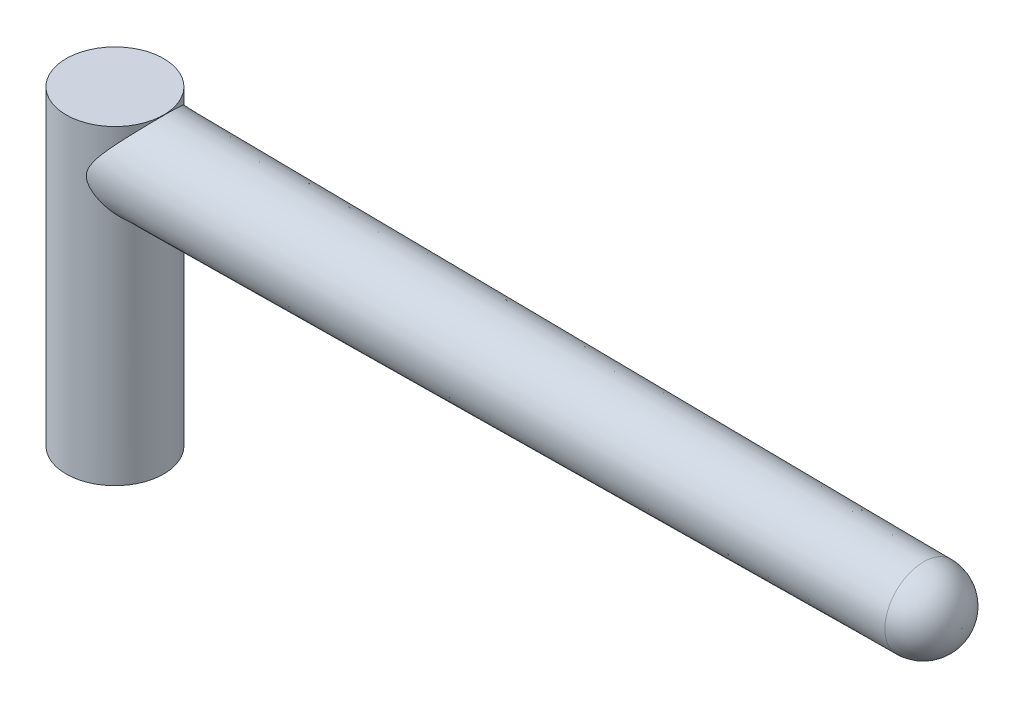
ISO-10303-21;
HEADER;
FILE_DESCRIPTION(('STEP AP214'),'2;1');
FILE_NAME('part.step','',(''),(''),'','','');
FILE_SCHEMA(('AUTOMOTIVE_DESIGN { 1 0 10303 214 1 1 1 1 }'));
ENDSEC;
DATA;
#1=APPLICATION_CONTEXT('core data for automotive mechanical design processes');
#2=APPLICATION_PROTOCOL_DEFINITION('international standard','automotive_design',2000,#1);
#3=PRODUCT_CONTEXT('',#1,'mechanical');
#4=PRODUCT('Part','Part','',(#3));
#5=PRODUCT_RELATED_PRODUCT_CATEGORY('part','',(#4));
#6=PRODUCT_DEFINITION_FORMATION('','',#4);
#7=PRODUCT_DEFINITION_CONTEXT('part definition',#1,'design');
#8=PRODUCT_DEFINITION('design','',#6,#7);
#9=PRODUCT_DEFINITION_SHAPE('','',#8);
#10=(LENGTH_UNIT() NAMED_UNIT(*) SI_UNIT(.MILLI.,.METRE.));
#11=(NAMED_UNIT(*) PLANE_ANGLE_UNIT() SI_UNIT($,.RADIAN.));
#12=(NAMED_UNIT(*) SI_UNIT($,.STERADIAN.) SOLID_ANGLE_UNIT());
#13=UNCERTAINTY_MEASURE_WITH_UNIT(LENGTH_MEASURE(1.E-05),#10,'distance_accuracy_value','');
#14=(GEOMETRIC_REPRESENTATION_CONTEXT(3) GLOBAL_UNCERTAINTY_ASSIGNED_CONTEXT((#13)) GLOBAL_UNIT_ASSIGNED_CONTEXT((#10,
#11,#12)) REPRESENTATION_CONTEXT('',''));
#15=CARTESIAN_POINT('',(0.,0.,0.));
#16=DIRECTION('',(0.,0.,1.));
#17=DIRECTION('',(1.,0.,0.));
#18=AXIS2_PLACEMENT_3D('',#15,#16,#17);
#19=CARTESIAN_POINT('',(0.,31.55,0.));
#20=DIRECTION('',(0.,-1.,0.));
#21=DIRECTION('',(0.,0.,-1.));
#22=AXIS2_PLACEMENT_3D('',#19,#20,#21);
#23=CYLINDRICAL_SURFACE('',#22,4.95);
#24=CARTESIAN_POINT('',(0.,31.55,0.));
#25=DIRECTION('',(0.,1.,0.));
#26=DIRECTION('',(0.,0.,1.));
#27=AXIS2_PLACEMENT_3D('',#24,#25,#26);
#28=CIRCLE('',#27,4.95);
#29=CARTESIAN_POINT('',(0.,31.55,4.95));
#30=VERTEX_POINT('',#29);
#31=EDGE_CURVE('E50',#30,#30,#28,.T.);
#32=ORIENTED_EDGE('',*,*,#31,.F.);
#33=EDGE_LOOP('',(#32));
#34=FACE_BOUND('',#33,.T.);
#35=CARTESIAN_POINT('',(0.,0.,0.));
#36=DIRECTION('',(0.,1.,0.));
#37=DIRECTION('',(0.,0.,1.));
#38=AXIS2_PLACEMENT_3D('',#35,#36,#37);
#39=CIRCLE('',#38,4.95);
#40=CARTESIAN_POINT('',(0.,0.,4.95));
#41=VERTEX_POINT('',#40);
#42=EDGE_CURVE('E53',#41,#41,#39,.T.);
#43=ORIENTED_EDGE('',*,*,#42,.T.);
#44=EDGE_LOOP('',(#43));
#45=FACE_BOUND('',#44,.T.);
#46=CARTESIAN_POINT('',(2.28781793438736,25.4273050165414,-4.38957732579067));
#47=CARTESIAN_POINT('',(2.21650894022856,25.5361198173086,-4.42674227521742));
#48=CARTESIAN_POINT('',(2.14772724216028,25.6478296242196,-4.46035954588733));
#49=CARTESIAN_POINT('',(2.01928691409521,25.8786399118595,-4.51995186240702));
#50=CARTESIAN_POINT('',(1.95963329369808,25.997744400836,-4.54592271898541));
#51=CARTESIAN_POINT('',(1.86778445750881,26.2180882624416,-4.58430195046838));
#52=CARTESIAN_POINT('',(1.83244353701365,26.3176696921617,-4.5984252762713));
#53=CARTESIAN_POINT('',(1.77699901912893,26.5215053165355,-4.62013883353317));
#54=CARTESIAN_POINT('',(1.7568359839934,26.6257395723951,-4.627754565237));
#55=CARTESIAN_POINT('',(1.73590467946259,26.8377711945457,-4.63565536597141));
#56=CARTESIAN_POINT('',(1.7353592689416,26.9455955823065,-4.63585620145367));
#57=CARTESIAN_POINT('',(1.75440775783245,27.1592711360822,-4.62867432969068));
#58=CARTESIAN_POINT('',(1.77404591633172,27.2651174452189,-4.62127495651992));
#59=CARTESIAN_POINT('',(1.83730139383993,27.5031869731301,-4.59654577973382));
#60=CARTESIAN_POINT('',(1.88640038479159,27.633625099164,-4.57687783801081));
#61=CARTESIAN_POINT('',(2.00025384433547,27.8857793653979,-4.52828108159995));
#62=CARTESIAN_POINT('',(2.06507682329749,28.0074542293705,-4.49931155548616));
#63=CARTESIAN_POINT('',(2.20999570150365,28.2550219764161,-4.43006770159249));
#64=CARTESIAN_POINT('',(2.29096616560526,28.3801567522372,-4.38896289451082));
#65=CARTESIAN_POINT('',(2.45803767035512,28.6235751141388,-4.2976338294443));
#66=CARTESIAN_POINT('',(2.54414400430554,28.7418513750099,-4.24740004960907));
#67=CARTESIAN_POINT('',(2.71857228777016,28.9727430176316,-4.13793341319676));
#68=CARTESIAN_POINT('',(2.80689724888428,29.0853500034846,-4.07868770362776));
#69=CARTESIAN_POINT('',(2.98364822453042,29.3051892535161,-3.95123029806244));
#70=CARTESIAN_POINT('',(3.07207418568949,29.4124236131034,-3.88302213576178));
#71=CARTESIAN_POINT('',(3.25829856388539,29.6344015477171,-3.72858569358579));
#72=CARTESIAN_POINT('',(3.35592703116854,29.7484693650162,-3.64117448315925));
#73=CARTESIAN_POINT('',(3.54778952870694,29.9696656996138,-3.45450713855602));
#74=CARTESIAN_POINT('',(3.64202251627872,30.0767920932677,-3.35524740561864));
#75=CARTESIAN_POINT('',(3.82513105991769,30.2829763933854,-3.1448770310993));
#76=CARTESIAN_POINT('',(3.91402097442333,30.3820562008546,-3.03380059807286));
#77=CARTESIAN_POINT('',(4.08492946219868,30.5712432738537,-2.79944823099543));
#78=CARTESIAN_POINT('',(4.16694933336831,30.6613522347799,-2.67617461089971));
#79=CARTESIAN_POINT('',(4.34744721343978,30.8586569200352,-2.37529940168263));
#80=CARTESIAN_POINT('',(4.44265456724087,30.9619373871848,-2.19303143110867));
#81=CARTESIAN_POINT('',(4.57006437578046,31.0995794845686,-1.90475474385813));
#82=CARTESIAN_POINT('',(4.60997652518693,31.1425901089802,-1.80615347975306));
#83=CARTESIAN_POINT('',(4.68403077989546,31.2222536938086,-1.60433449535115));
#84=CARTESIAN_POINT('',(4.71817531778756,31.2589093347226,-1.50111874464089));
#85=CARTESIAN_POINT('',(4.78036431706026,31.3255841552543,-1.28953459390753));
#86=CARTESIAN_POINT('',(4.80834395866856,31.3555328651564,-1.18112480519249));
#87=CARTESIAN_POINT('',(4.85713958971595,31.4077136593642,-0.960936768357306));
#88=CARTESIAN_POINT('',(4.87795944671516,31.4299499098288,-0.849160374407476));
#89=CARTESIAN_POINT('',(4.91194166132246,31.4662233879107,-0.62319702102715));
#90=CARTESIAN_POINT('',(4.92510838022125,31.4802652852589,-0.509011473025791));
#91=CARTESIAN_POINT('',(4.94345758671752,31.4998299274827,-0.279281466228644));
#92=CARTESIAN_POINT('',(4.94864129445238,31.5053539742416,-0.163737217819751));
#93=CARTESIAN_POINT('',(4.95073482506385,31.5075851246818,0.0514535153918337));
#94=CARTESIAN_POINT('',(4.94869295543598,31.5054093397207,0.151081169994964));
#95=CARTESIAN_POINT('',(4.93863209452331,31.4946848864126,0.349721542598301));
#96=CARTESIAN_POINT('',(4.93061124696823,31.4861342388862,0.448734059990909));
#97=CARTESIAN_POINT('',(4.90874898475291,31.4628143603558,0.645336429985007));
#98=CARTESIAN_POINT('',(4.89490968132984,31.448047384955,0.742926785344393));
#99=CARTESIAN_POINT('',(4.86167635822419,31.4125560278116,0.936069601831927));
#100=CARTESIAN_POINT('',(4.84228013240699,31.3918292799883,1.03162123735451));
#101=CARTESIAN_POINT('',(4.77727052454199,31.3222847702775,1.30988350439889));
#102=CARTESIAN_POINT('',(4.72427582661454,31.2655075473896,1.48898358914613));
#103=CARTESIAN_POINT('',(4.60144013806822,31.1334373797211,1.8338197189327));
#104=CARTESIAN_POINT('',(4.53159451010402,31.0581393379333,1.99955206841404));
#105=CARTESIAN_POINT('',(4.34314191142474,30.8539896956094,2.38854749877702));
#106=CARTESIAN_POINT('',(4.21682701377679,30.7163787172559,2.60355891832126));
#107=CARTESIAN_POINT('',(4.01246440525861,30.4911601608814,2.90125268864578));
#108=CARTESIAN_POINT('',(3.94171242696704,30.412785914003,2.99650468959552));
#109=CARTESIAN_POINT('',(3.79619944221964,30.250436670096,3.1788268740449));
#110=CARTESIAN_POINT('',(3.7214394322717,30.1664630639694,3.26589907658767));
#111=CARTESIAN_POINT('',(3.54485213248064,29.9662870022414,3.45810796784697));
#112=CARTESIAN_POINT('',(3.44190804381741,29.8482557955385,3.56031115931118));
#113=CARTESIAN_POINT('',(3.23277826191984,29.6043008747278,3.75122511649139));
#114=CARTESIAN_POINT('',(3.12659067992326,29.4783725151811,3.83992783351558));
#115=CARTESIAN_POINT('',(2.91347992732393,29.2190562638331,4.00402187976647));
#116=CARTESIAN_POINT('',(2.8065578493715,29.0856779494506,4.07942980430591));
#117=CARTESIAN_POINT('',(2.59491693439772,28.8108310136355,4.21720025087995));
#118=CARTESIAN_POINT('',(2.49019625732384,28.6693695488988,4.27957409198802));
#119=CARTESIAN_POINT('',(2.30594126200918,28.4027161891744,4.38111219938588));
#120=CARTESIAN_POINT('',(2.22525504416135,28.279147689461,4.42243253766062));
#121=CARTESIAN_POINT('',(2.0734924232246,28.0234240681959,4.49557006078444));
#122=CARTESIAN_POINT('',(2.00240700283987,27.8912771788833,4.52739619726157));
#123=CARTESIAN_POINT('',(1.89676970163224,27.6560499161001,4.57242609640247));
#124=CARTESIAN_POINT('',(1.85759928051292,27.555632434351,4.58835368954977));
#125=CARTESIAN_POINT('',(1.79386673667717,27.3495892326261,4.6136458669002));
#126=CARTESIAN_POINT('',(1.76925446364398,27.243982766005,4.62303300198252));
#127=CARTESIAN_POINT('',(1.73948943496803,27.0279087642032,4.63432719658284));
#128=CARTESIAN_POINT('',(1.73461775259035,26.9173935161789,4.63612622871277));
#129=CARTESIAN_POINT('',(1.74652225740149,26.6976710439283,4.63164934944115));
#130=CARTESIAN_POINT('',(1.76332636780467,26.5884656901783,4.62536302233914));
#131=CARTESIAN_POINT('',(1.81966010925746,26.3526348054951,4.60351651141505));
#132=CARTESIAN_POINT('',(1.86323715491548,26.2271964024191,4.58627922023376));
#133=CARTESIAN_POINT('',(1.96608750866608,25.9843231460072,4.54313875431822));
#134=CARTESIAN_POINT('',(2.02543292645681,25.8669282600467,4.51719562015944));
#135=CARTESIAN_POINT('',(2.15830734153674,25.6296025489476,4.45533770110933));
#136=CARTESIAN_POINT('',(2.23260934951442,25.510288396693,4.41876791065955));
#137=CARTESIAN_POINT('',(2.38671137302452,25.278077163914,4.33747992318447));
#138=CARTESIAN_POINT('',(2.46651722337362,25.1651871325312,4.29275299327638));
#139=CARTESIAN_POINT('',(2.62880388486888,24.9446633869601,4.19533883257892));
#140=CARTESIAN_POINT('',(2.71128809120439,24.837036815237,4.14264116163889));
#141=CARTESIAN_POINT('',(2.87693436450814,24.6266594945694,4.02937020503473));
#142=CARTESIAN_POINT('',(2.96009614283232,24.5239067848343,3.96880012381608));
#143=CARTESIAN_POINT('',(3.13784012511996,24.3084064373732,3.83026415678702));
#144=CARTESIAN_POINT('',(3.23232656321139,24.1963749801108,3.75104941256317));
#145=CARTESIAN_POINT('',(3.41882472960687,23.9785410720731,3.58190268800724));
#146=CARTESIAN_POINT('',(3.51083577007814,23.8727403431007,3.49196776582579));
#147=CARTESIAN_POINT('',(3.78058043915593,23.5658343396288,3.20595426089547));
#148=CARTESIAN_POINT('',(3.95263273541775,23.3745068544765,2.99321239767824));
#149=CARTESIAN_POINT('',(4.22417248537054,23.0757666711947,2.58854955816415));
#150=CARTESIAN_POINT('',(4.33049604097054,22.9598512234471,2.4074493556802));
#151=CARTESIAN_POINT('',(4.52303618373382,22.7510264864285,2.02255827007092));
#152=CARTESIAN_POINT('',(4.60927622791063,22.6580903500083,1.81879427305436));
#153=CARTESIAN_POINT('',(4.74460288395123,22.5126905855683,1.42406081779512));
#154=CARTESIAN_POINT('',(4.79733870868405,22.4562286101423,1.23582925606702));
#155=CARTESIAN_POINT('',(4.88064146898919,22.3671625475679,0.849044790403938));
#156=CARTESIAN_POINT('',(4.91122178831291,22.3345440568827,0.650498195424315));
#157=CARTESIAN_POINT('',(4.94793780359196,22.2953908157077,0.247818300963499));
#158=CARTESIAN_POINT('',(4.95398365288837,22.2889519363149,0.0436672188725716));
#159=CARTESIAN_POINT('',(4.940868401769,22.3029307822806,-0.362889426300624));
#160=CARTESIAN_POINT('',(4.92170598170555,22.3233499136504,-0.565294897442178));
#161=CARTESIAN_POINT('',(4.86156250202235,22.3875569166374,-0.950550000533948));
#162=CARTESIAN_POINT('',(4.82191000073014,22.4299221942183,-1.13385320452535));
#163=CARTESIAN_POINT('',(4.7242079382313,22.5345934110943,-1.48943334569321));
#164=CARTESIAN_POINT('',(4.66615321174019,22.5969049491146,-1.66170717071648));
#165=CARTESIAN_POINT('',(4.51070289838678,22.7643975870737,-2.05306019480158));
#166=CARTESIAN_POINT('',(4.40667901998435,22.8769273804271,-2.26635735123431));
#167=CARTESIAN_POINT('',(4.17744929090343,23.1269519559738,-2.66545186105747));
#168=CARTESIAN_POINT('',(4.05219157267454,23.264507930948,-2.85117973617212));
#169=CARTESIAN_POINT('',(3.83084805752375,23.5106836846429,-3.13820539142002));
#170=CARTESIAN_POINT('',(3.73865878538307,23.6140082193015,-3.24722252202442));
#171=CARTESIAN_POINT('',(3.54957495631807,23.8283686195388,-3.45290053126346));
#172=CARTESIAN_POINT('',(3.45268033613337,23.9394045888012,-3.54956124371052));
#173=CARTESIAN_POINT('',(3.25602869987991,24.1683859415132,-3.73077000390235));
#174=CARTESIAN_POINT('',(3.15627343054518,24.2863271525481,-3.81532526195034));
#175=CARTESIAN_POINT('',(2.95577795736067,24.5289049900467,-3.97266728156294));
#176=CARTESIAN_POINT('',(2.85503827573219,24.6535382090812,-4.04545995808218));
#177=CARTESIAN_POINT('',(2.67494018855746,24.8843464180221,-4.16611192357789));
#178=CARTESIAN_POINT('',(2.59532650148634,24.9892420309535,-4.21604807769578));
#179=CARTESIAN_POINT('',(2.43883838982343,25.2041526650427,-4.30845682967875));
#180=CARTESIAN_POINT('',(2.36196203620352,25.3141639498028,-4.35093476987195));
#181=CARTESIAN_POINT('',(2.28781793438736,25.4273050165414,-4.38957732579067));
#182=B_SPLINE_CURVE_WITH_KNOTS('',3,(#46,#47,#48,#49,#50,#51,#52,#53,#54,#55,#56,#57,#58,#59,
#60,#61,#62,#63,#64,#65,#66,#67,#68,#69,#70,#71,#72,#73,#74,#75,#76,#77,#78,#79,#80,#81,#82,#83,
#84,#85,#86,#87,#88,#89,#90,#91,#92,#93,#94,#95,#96,#97,#98,#99,#100,#101,#102,#103,#104,#105,
#106,#107,#108,#109,#110,#111,#112,#113,#114,#115,#116,#117,#118,#119,#120,#121,#122,#123,#124,
#125,#126,#127,#128,#129,#130,#131,#132,#133,#134,#135,#136,#137,#138,#139,#140,#141,#142,#143,
#144,#145,#146,#147,#148,#149,#150,#151,#152,#153,#154,#155,#156,#157,#158,#159,#160,#161,#162,
#163,#164,#165,#166,#167,#168,#169,#170,#171,#172,#173,#174,#175,#176,#177,#178,#179,#180,#181),
.UNSPECIFIED.,.T.,.F.,(4,2,2,2,2,2,2,2,2,2,2,2,2,2,2,2,2,2,2,2,2,2,2,2,2,2,2,2,2,2,2,2,2,2,2,2,
2,2,2,2,2,2,2,2,2,2,2,2,2,2,2,2,2,2,2,2,2,2,2,2,2,2,2,2,2,2,2,4),(0.,0.405805038090635,
0.811831994242548,1.13064432218172,1.44820156722637,1.76936517973502,2.09123455438548,
2.51113652185093,2.93290197027303,3.39606284936423,3.85970962411706,4.32402397095748,
4.78815579524567,5.30880722172573,5.82961719037186,6.34895849001223,6.86820145249364,
7.55557965728101,7.89946281555131,8.24320057102503,8.59039619929523,8.93740398434374,
9.28421382583651,9.63097065504425,9.92960987862305,10.2283418582096,10.5269655357835,
10.8257079335924,11.4088123661953,11.9920774514896,12.8414605832486,13.2677831014837,
13.6940001112843,14.2542907563083,14.8149141370116,15.3748326833574,15.9342629451141,
16.3935050576746,16.8523127942857,17.1782726389042,17.5031029678259,17.8325424277287,
18.1624067026418,18.5618821625002,18.9632168636847,19.3982952686068,19.8338422242485,
20.2699646842384,20.705910174375,21.2051792068833,21.7045855664441,22.7002957977163,
23.4174943646055,24.1338510134864,24.7416880176107,25.3491575312332,25.9588496370197,
26.5685736613312,27.142968823043,27.717525353585,28.5011737198997,29.2867646259023,
29.8148420521962,30.3429265801176,30.8706952476415,31.3981976888868,31.82044044825,
32.2423795096074),.UNSPECIFIED.);
#183=CARTESIAN_POINT('',(2.28781793438736,25.4273050165414,-4.38957732579067));
#184=VERTEX_POINT('',#183);
#185=EDGE_CURVE('E52',#184,#184,#182,.T.);
#186=ORIENTED_EDGE('',*,*,#185,.F.);
#187=EDGE_LOOP('',(#186));
#188=FACE_BOUND('',#187,.T.);
#189=ADVANCED_FACE('F33',(#34,#45,#188),#23,.T.);
#190=CARTESIAN_POINT('',(0.,31.55,0.));
#191=DIRECTION('',(0.,1.,0.));
#192=DIRECTION('',(0.,0.,1.));
#193=AXIS2_PLACEMENT_3D('',#190,#191,#192);
#194=PLANE('',#193);
#195=CARTESIAN_POINT('',(0.,31.55,0.));
#196=VERTEX_POINT('',#195);
#197=VERTEX_LOOP('',#196);
#198=FACE_BOUND('',#197,.T.);
#199=ORIENTED_EDGE('',*,*,#31,.T.);
#200=EDGE_LOOP('',(#199));
#201=FACE_BOUND('',#200,.T.);
#202=ADVANCED_FACE('F43',(#198,#201),#194,.T.);
#203=CARTESIAN_POINT('',(0.,0.,0.));
#204=DIRECTION('',(0.,1.,0.));
#205=DIRECTION('',(0.,0.,1.));
#206=AXIS2_PLACEMENT_3D('',#203,#204,#205);
#207=PLANE('',#206);
#208=CARTESIAN_POINT('',(0.,0.,0.));
#209=DIRECTION('',(0.,-1.,0.));
#210=DIRECTION('',(0.,0.,-1.));
#211=AXIS2_PLACEMENT_3D('',#208,#209,#210);
#212=CIRCLE('',#211,3.07);
#213=CARTESIAN_POINT('',(0.,0.,-3.07));
#214=VERTEX_POINT('',#213);
#215=EDGE_CURVE('E101',#214,#214,#212,.T.);
#216=ORIENTED_EDGE('',*,*,#215,.F.);
#217=EDGE_LOOP('',(#216));
#218=FACE_BOUND('',#217,.T.);
#219=ORIENTED_EDGE('',*,*,#42,.F.);
#220=EDGE_LOOP('',(#219));
#221=FACE_BOUND('',#220,.T.);
#222=ADVANCED_FACE('F46',(#218,#221),#207,.F.);
#223=CARTESIAN_POINT('',(0.,26.9,0.));
#224=DIRECTION('',(-1.,0.,0.));
#225=DIRECTION('',(0.,0.,-1.));
#226=AXIS2_PLACEMENT_3D('',#223,#224,#225);
#227=CONICAL_SURFACE('',#226,4.65,0.00872664625997167);
#228=CARTESIAN_POINT('',(82.0340334884437,26.9,0.));
#229=DIRECTION('',(-1.,0.,0.));
#230=DIRECTION('',(0.,0.,1.));
#231=AXIS2_PLACEMENT_3D('',#228,#229,#230);
#232=CIRCLE('',#231,3.93409983540367);
#233=CARTESIAN_POINT('',(82.0340334884437,26.9,3.93409983540367));
#234=VERTEX_POINT('',#233);
#235=EDGE_CURVE('E11',#234,#234,#232,.T.);
#236=ORIENTED_EDGE('',*,*,#235,.T.);
#237=EDGE_LOOP('',(#236));
#238=FACE_BOUND('',#237,.T.);
#239=ORIENTED_EDGE('',*,*,#185,.T.);
#240=EDGE_LOOP('',(#239));
#241=FACE_BOUND('',#240,.T.);
#242=ADVANCED_FACE('F80',(#238,#241),#227,.T.);
#243=CARTESIAN_POINT('',(85.9,26.9,0.));
#244=DIRECTION('',(1.,0.,0.));
#245=DIRECTION('',(0.,0.,-1.));
#246=AXIS2_PLACEMENT_3D('',#243,#244,#245);
#247=PLANE('',#246);
#248=CARTESIAN_POINT('',(85.9,26.9,0.));
#249=DIRECTION('',(1.,0.,0.));
#250=DIRECTION('',(0.,0.,-1.));
#251=AXIS2_PLACEMENT_3D('',#248,#249,#250);
#252=CIRCLE('',#251,0.0342483354534041);
#253=CARTESIAN_POINT('',(85.9,26.9,-0.0342483354534041));
#254=VERTEX_POINT('',#253);
#255=EDGE_CURVE('E40',#254,#254,#252,.T.);
#256=ORIENTED_EDGE('',*,*,#255,.T.);
#257=EDGE_LOOP('',(#256));
#258=FACE_BOUND('',#257,.T.);
#259=ADVANCED_FACE('F68',(#258),#247,.T.);
#260=CARTESIAN_POINT('',(82.,26.9,0.));
#261=DIRECTION('',(1.,0.,0.));
#262=DIRECTION('',(0.,0.,-1.));
#263=AXIS2_PLACEMENT_3D('',#260,#261,#262);
#264=DEGENERATE_TOROIDAL_SURFACE('',#263,0.0342483354534041,3.9,.T.);
#265=ORIENTED_EDGE('',*,*,#235,.F.);
#266=EDGE_LOOP('',(#265));
#267=FACE_BOUND('',#266,.T.);
#268=ORIENTED_EDGE('',*,*,#255,.F.);
#269=EDGE_LOOP('',(#268));
#270=FACE_BOUND('',#269,.T.);
#271=ADVANCED_FACE('F35',(#267,#270),#264,.T.);
#272=CARTESIAN_POINT('',(0.,5.3,0.));
#273=DIRECTION('',(0.,-1.,0.));
#274=DIRECTION('',(0.,0.,-1.));
#275=AXIS2_PLACEMENT_3D('',#272,#273,#274);
#276=CYLINDRICAL_SURFACE('',#275,3.07);
#277=CARTESIAN_POINT('',(0.,5.3,0.));
#278=DIRECTION('',(0.,-1.,0.));
#279=DIRECTION('',(0.,0.,-1.));
#280=AXIS2_PLACEMENT_3D('',#277,#278,#279);
#281=CIRCLE('',#280,3.07);
#282=CARTESIAN_POINT('',(0.,5.3,-3.07));
#283=VERTEX_POINT('',#282);
#284=EDGE_CURVE('E58',#283,#283,#281,.T.);
#285=ORIENTED_EDGE('',*,*,#284,.F.);
#286=EDGE_LOOP('',(#285));
#287=FACE_BOUND('',#286,.T.);
#288=ORIENTED_EDGE('',*,*,#215,.T.);
#289=EDGE_LOOP('',(#288));
#290=FACE_BOUND('',#289,.T.);
#291=ADVANCED_FACE('F71',(#287,#290),#276,.F.);
#292=CARTESIAN_POINT('',(0.,5.3,0.));
#293=DIRECTION('',(0.,-1.,0.));
#294=DIRECTION('',(0.,0.,-1.));
#295=AXIS2_PLACEMENT_3D('',#292,#293,#294);
#296=PLANE('',#295);
#297=ORIENTED_EDGE('',*,*,#284,.T.);
#298=EDGE_LOOP('',(#297));
#299=FACE_BOUND('',#298,.T.);
#300=ADVANCED_FACE('F77',(#299),#296,.T.);
#301=CLOSED_SHELL('',(#189,#202,#222,#242,#259,#271,#291,#300));
#302=MANIFOLD_SOLID_BREP('B2',#301);
#303=ADVANCED_BREP_SHAPE_REPRESENTATION('',(#18,#302),#14);
#304=SHAPE_DEFINITION_REPRESENTATION(#9,#303);
ENDSEC;
END-ISO-10303-21;
